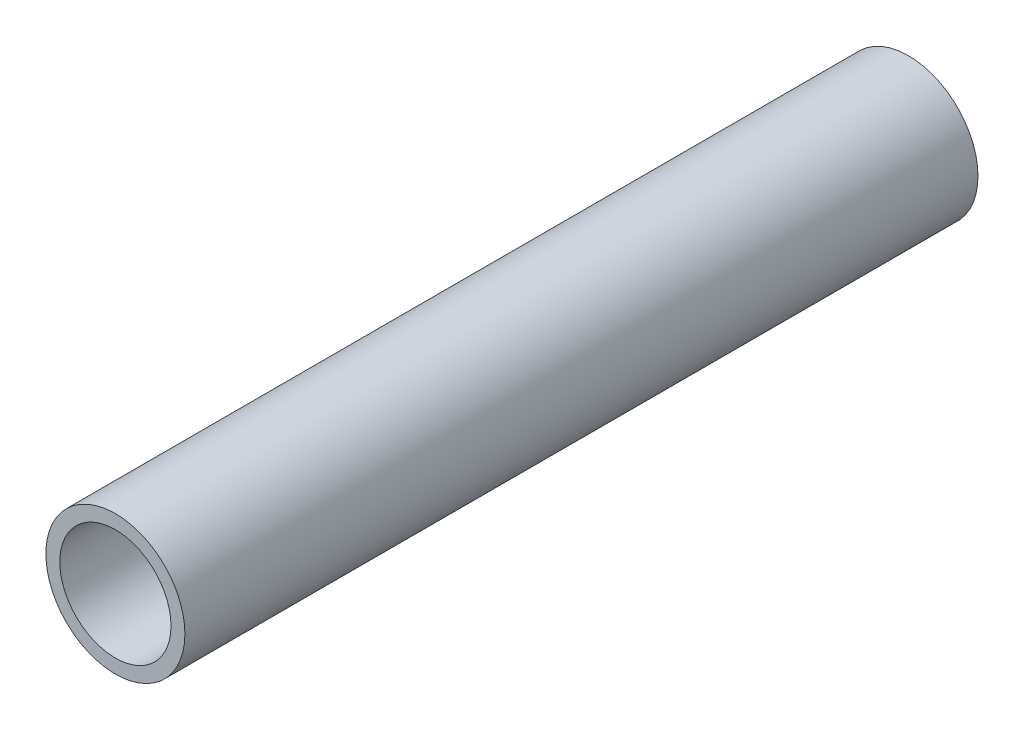
ISO-10303-21;
HEADER;
FILE_DESCRIPTION(('STEP AP214'),'2;1');
FILE_NAME('part.step','',(''),(''),'','','');
FILE_SCHEMA(('AUTOMOTIVE_DESIGN { 1 0 10303 214 1 1 1 1 }'));
ENDSEC;
DATA;
#1=APPLICATION_CONTEXT('core data for automotive mechanical design processes');
#2=APPLICATION_PROTOCOL_DEFINITION('international standard','automotive_design',2000,#1);
#3=PRODUCT_CONTEXT('',#1,'mechanical');
#4=PRODUCT('Part','Part','',(#3));
#5=PRODUCT_RELATED_PRODUCT_CATEGORY('part','',(#4));
#6=PRODUCT_DEFINITION_FORMATION('','',#4);
#7=PRODUCT_DEFINITION_CONTEXT('part definition',#1,'design');
#8=PRODUCT_DEFINITION('design','',#6,#7);
#9=PRODUCT_DEFINITION_SHAPE('','',#8);
#10=(LENGTH_UNIT() NAMED_UNIT(*) SI_UNIT(.MILLI.,.METRE.));
#11=(NAMED_UNIT(*) PLANE_ANGLE_UNIT() SI_UNIT($,.RADIAN.));
#12=(NAMED_UNIT(*) SI_UNIT($,.STERADIAN.) SOLID_ANGLE_UNIT());
#13=UNCERTAINTY_MEASURE_WITH_UNIT(LENGTH_MEASURE(1.E-05),#10,'distance_accuracy_value','');
#14=(GEOMETRIC_REPRESENTATION_CONTEXT(3) GLOBAL_UNCERTAINTY_ASSIGNED_CONTEXT((#13)) GLOBAL_UNIT_ASSIGNED_CONTEXT((#10,
#11,#12)) REPRESENTATION_CONTEXT('',''));
#15=CARTESIAN_POINT('',(0.,0.,0.));
#16=DIRECTION('',(0.,0.,1.));
#17=DIRECTION('',(1.,0.,0.));
#18=AXIS2_PLACEMENT_3D('',#15,#16,#17);
#19=CARTESIAN_POINT('',(0.,0.,14.26));
#20=DIRECTION('',(0.,0.,1.));
#21=DIRECTION('',(1.,0.,0.));
#22=AXIS2_PLACEMENT_3D('',#19,#20,#21);
#23=PLANE('',#22);
#24=CARTESIAN_POINT('',(0.,0.,14.26));
#25=DIRECTION('',(0.,0.,1.));
#26=DIRECTION('',(1.,0.,0.));
#27=AXIS2_PLACEMENT_3D('',#24,#25,#26);
#28=CIRCLE('',#27,1.25);
#29=CARTESIAN_POINT('',(1.25,0.,14.26));
#30=VERTEX_POINT('',#29);
#31=EDGE_CURVE('E10',#30,#30,#28,.T.);
#32=ORIENTED_EDGE('',*,*,#31,.T.);
#33=EDGE_LOOP('',(#32));
#34=FACE_BOUND('',#33,.T.);
#35=CARTESIAN_POINT('',(0.,0.,14.26));
#36=DIRECTION('',(0.,0.,1.));
#37=DIRECTION('',(1.,0.,0.));
#38=AXIS2_PLACEMENT_3D('',#35,#36,#37);
#39=CIRCLE('',#38,1.);
#40=CARTESIAN_POINT('',(1.,0.,14.26));
#41=VERTEX_POINT('',#40);
#42=EDGE_CURVE('E41',#41,#41,#39,.T.);
#43=ORIENTED_EDGE('',*,*,#42,.F.);
#44=EDGE_LOOP('',(#43));
#45=FACE_BOUND('',#44,.T.);
#46=ADVANCED_FACE('F30',(#34,#45),#23,.T.);
#47=CARTESIAN_POINT('',(0.,0.,0.));
#48=DIRECTION('',(0.,0.,1.));
#49=DIRECTION('',(1.,0.,0.));
#50=AXIS2_PLACEMENT_3D('',#47,#48,#49);
#51=PLANE('',#50);
#52=CARTESIAN_POINT('',(0.,0.,0.));
#53=DIRECTION('',(0.,0.,1.));
#54=DIRECTION('',(1.,0.,0.));
#55=AXIS2_PLACEMENT_3D('',#52,#53,#54);
#56=CIRCLE('',#55,1.25);
#57=CARTESIAN_POINT('',(1.25,0.,0.));
#58=VERTEX_POINT('',#57);
#59=EDGE_CURVE('E34',#58,#58,#56,.T.);
#60=ORIENTED_EDGE('',*,*,#59,.F.);
#61=EDGE_LOOP('',(#60));
#62=FACE_BOUND('',#61,.T.);
#63=CARTESIAN_POINT('',(0.,0.,0.));
#64=DIRECTION('',(0.,0.,1.));
#65=DIRECTION('',(1.,0.,0.));
#66=AXIS2_PLACEMENT_3D('',#63,#64,#65);
#67=CIRCLE('',#66,1.);
#68=CARTESIAN_POINT('',(1.,0.,0.));
#69=VERTEX_POINT('',#68);
#70=EDGE_CURVE('E43',#69,#69,#67,.T.);
#71=ORIENTED_EDGE('',*,*,#70,.T.);
#72=EDGE_LOOP('',(#71));
#73=FACE_BOUND('',#72,.T.);
#74=ADVANCED_FACE('F53',(#62,#73),#51,.F.);
#75=CARTESIAN_POINT('',(0.,0.,14.26));
#76=DIRECTION('',(0.,0.,-1.));
#77=DIRECTION('',(-1.,0.,0.));
#78=AXIS2_PLACEMENT_3D('',#75,#76,#77);
#79=CYLINDRICAL_SURFACE('',#78,1.25);
#80=ORIENTED_EDGE('',*,*,#31,.F.);
#81=EDGE_LOOP('',(#80));
#82=FACE_BOUND('',#81,.T.);
#83=ORIENTED_EDGE('',*,*,#59,.T.);
#84=EDGE_LOOP('',(#83));
#85=FACE_BOUND('',#84,.T.);
#86=ADVANCED_FACE('F32',(#82,#85),#79,.T.);
#87=CARTESIAN_POINT('',(0.,0.,14.26));
#88=DIRECTION('',(0.,0.,-1.));
#89=DIRECTION('',(-1.,0.,0.));
#90=AXIS2_PLACEMENT_3D('',#87,#88,#89);
#91=CYLINDRICAL_SURFACE('',#90,1.);
#92=ORIENTED_EDGE('',*,*,#42,.T.);
#93=EDGE_LOOP('',(#92));
#94=FACE_BOUND('',#93,.T.);
#95=ORIENTED_EDGE('',*,*,#70,.F.);
#96=EDGE_LOOP('',(#95));
#97=FACE_BOUND('',#96,.T.);
#98=ADVANCED_FACE('F49',(#94,#97),#91,.F.);
#99=CLOSED_SHELL('',(#46,#74,#86,#98));
#100=MANIFOLD_SOLID_BREP('B2',#99);
#101=ADVANCED_BREP_SHAPE_REPRESENTATION('',(#18,#100),#14);
#102=SHAPE_DEFINITION_REPRESENTATION(#9,#101);
ENDSEC;
END-ISO-10303-21;
